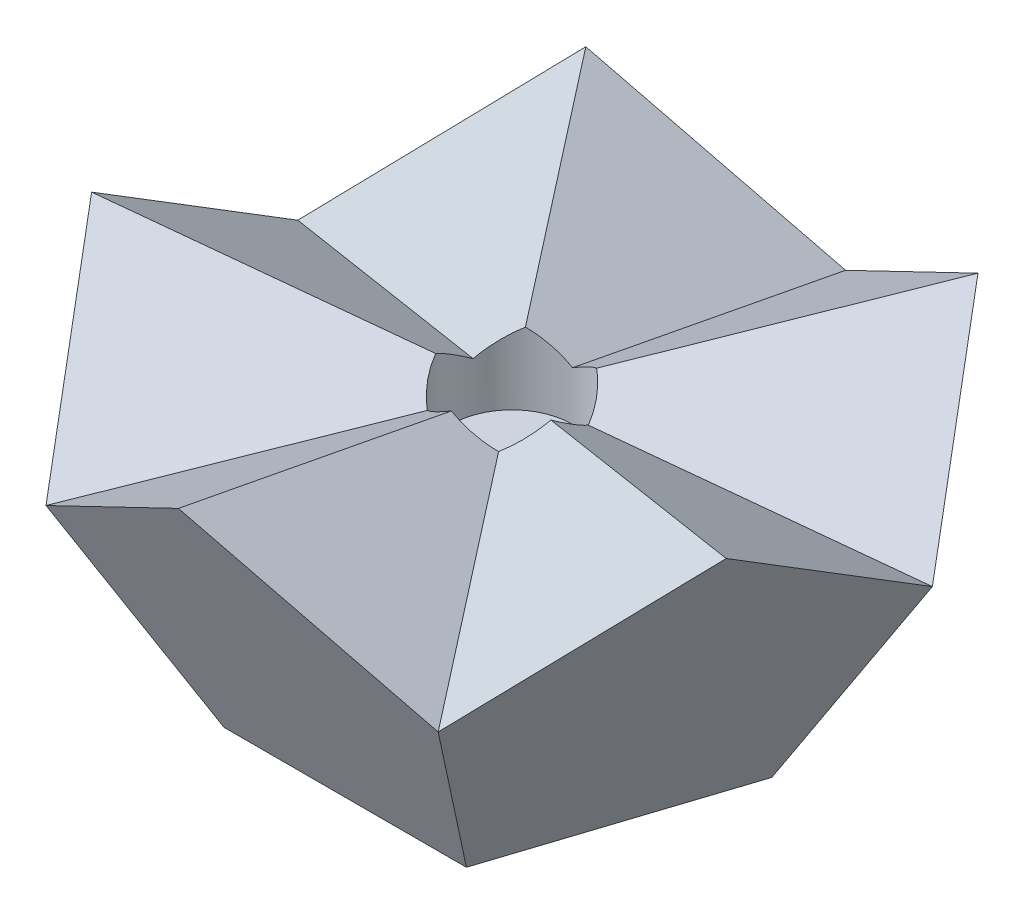
ISO-10303-21;
HEADER;
FILE_DESCRIPTION(('STEP AP214'),'2;1');
FILE_NAME('part.step','',(''),(''),'','','');
FILE_SCHEMA(('AUTOMOTIVE_DESIGN { 1 0 10303 214 1 1 1 1 }'));
ENDSEC;
DATA;
#1=APPLICATION_CONTEXT('core data for automotive mechanical design processes');
#2=APPLICATION_PROTOCOL_DEFINITION('international standard','automotive_design',2000,#1);
#3=PRODUCT_CONTEXT('',#1,'mechanical');
#4=PRODUCT('Part','Part','',(#3));
#5=PRODUCT_RELATED_PRODUCT_CATEGORY('part','',(#4));
#6=PRODUCT_DEFINITION_FORMATION('','',#4);
#7=PRODUCT_DEFINITION_CONTEXT('part definition',#1,'design');
#8=PRODUCT_DEFINITION('design','',#6,#7);
#9=PRODUCT_DEFINITION_SHAPE('','',#8);
#10=(LENGTH_UNIT() NAMED_UNIT(*) SI_UNIT(.MILLI.,.METRE.));
#11=(NAMED_UNIT(*) PLANE_ANGLE_UNIT() SI_UNIT($,.RADIAN.));
#12=(NAMED_UNIT(*) SI_UNIT($,.STERADIAN.) SOLID_ANGLE_UNIT());
#13=UNCERTAINTY_MEASURE_WITH_UNIT(LENGTH_MEASURE(1.E-05),#10,'distance_accuracy_value','');
#14=(GEOMETRIC_REPRESENTATION_CONTEXT(3) GLOBAL_UNCERTAINTY_ASSIGNED_CONTEXT((#13)) GLOBAL_UNIT_ASSIGNED_CONTEXT((#10,
#11,#12)) REPRESENTATION_CONTEXT('',''));
#15=CARTESIAN_POINT('',(0.,0.,0.));
#16=DIRECTION('',(0.,0.,1.));
#17=DIRECTION('',(1.,0.,0.));
#18=AXIS2_PLACEMENT_3D('',#15,#16,#17);
#19=CARTESIAN_POINT('',(0.,0.,0.));
#20=DIRECTION('',(0.,1.,0.));
#21=DIRECTION('',(0.,0.,1.));
#22=AXIS2_PLACEMENT_3D('',#19,#20,#21);
#23=PLANE('',#22);
#24=DIRECTION('',(-0.809016994374948,0.,-0.587785252292473));
#25=VECTOR('',#24,1.);
#26=CARTESIAN_POINT('',(10.2745158285618,0.,-3.3383925619565));
#27=LINE('',#26,#25);
#28=CARTESIAN_POINT('',(10.2745158285618,0.,-3.3383925619565));
#29=VERTEX_POINT('',#28);
#30=CARTESIAN_POINT('',(0.,0.,-10.8032652660709));
#31=VERTEX_POINT('',#30);
#32=EDGE_CURVE('E143',#29,#31,#27,.T.);
#33=ORIENTED_EDGE('',*,*,#32,.F.);
#34=DIRECTION('',(0.309016994374947,0.,-0.951056516295154));
#35=VECTOR('',#34,1.);
#36=CARTESIAN_POINT('',(6.35,0.,8.74002519499195));
#37=LINE('',#36,#35);
#38=CARTESIAN_POINT('',(6.35,0.,8.74002519499195));
#39=VERTEX_POINT('',#38);
#40=EDGE_CURVE('E42',#39,#29,#37,.T.);
#41=ORIENTED_EDGE('',*,*,#40,.F.);
#42=DIRECTION('',(1.,0.,0.));
#43=VECTOR('',#42,1.);
#44=CARTESIAN_POINT('',(-6.35,0.,8.74002519499195));
#45=LINE('',#44,#43);
#46=CARTESIAN_POINT('',(-6.35,0.,8.74002519499195));
#47=VERTEX_POINT('',#46);
#48=EDGE_CURVE('E156',#47,#39,#45,.T.);
#49=ORIENTED_EDGE('',*,*,#48,.F.);
#50=DIRECTION('',(0.309016994374948,0.,0.951056516295154));
#51=VECTOR('',#50,1.);
#52=CARTESIAN_POINT('',(-10.2745158285618,0.,-3.3383925619565));
#53=LINE('',#52,#51);
#54=CARTESIAN_POINT('',(-10.2745158285618,0.,-3.33839256195649));
#55=VERTEX_POINT('',#54);
#56=EDGE_CURVE('E153',#55,#47,#53,.T.);
#57=ORIENTED_EDGE('',*,*,#56,.F.);
#58=DIRECTION('',(-0.809016994374947,0.,0.587785252292473));
#59=VECTOR('',#58,1.);
#60=CARTESIAN_POINT('',(0.,0.,-10.8032652660709));
#61=LINE('',#60,#59);
#62=EDGE_CURVE('E146',#31,#55,#61,.T.);
#63=ORIENTED_EDGE('',*,*,#62,.F.);
#64=EDGE_LOOP('',(#33,#41,#49,#57,#63));
#65=FACE_BOUND('',#64,.T.);
#66=ADVANCED_FACE('F35',(#65),#23,.F.);
#67=CARTESIAN_POINT('',(10.2745158285618,17.4800503899839,-14.1416578280274));
#68=DIRECTION('',(0.309016994374945,0.850650808352039,0.425325404176022));
#69=DIRECTION('',(0.,-0.44721359549996,0.894427190999915));
#70=AXIS2_PLACEMENT_3D('',#67,#68,#69);
#71=PLANE('',#70);
#72=DIRECTION('',(0.577350269189625,0.187592474085084,-0.794654472291765));
#73=VECTOR('',#72,1.);
#74=CARTESIAN_POINT('',(7.65817194285392,16.6299487293989,-10.5405694060037));
#75=LINE('',#74,#73);
#76=CARTESIAN_POINT('',(1.8662181760286,14.7480288708869,-2.56862895714046));
#77=VERTEX_POINT('',#76);
#78=CARTESIAN_POINT('',(10.2745158285618,17.4800503899839,-14.1416578280274));
#79=VERTEX_POINT('',#78);
#80=EDGE_CURVE('E56',#77,#79,#75,.T.);
#81=ORIENTED_EDGE('',*,*,#80,.F.);
#82=CARTESIAN_POINT('',(0.,14.1416578280274,0.));
#83=DIRECTION('',(0.309016994374945,0.850650808352039,0.425325404176022));
#84=DIRECTION('',(-0.499999999999995,0.525731112119134,-0.68819096023559));
#85=AXIS2_PLACEMENT_3D('',#82,#83,#84);
#86=ELLIPSE('',#85,3.73243635205721,3.175);
#87=CARTESIAN_POINT('',(3.01960443923711,13.5352867851678,-0.981128957140464));
#88=VERTEX_POINT('',#87);
#89=EDGE_CURVE('E127',#77,#88,#86,.F.);
#90=ORIENTED_EDGE('',*,*,#89,.T.);
#91=DIRECTION('',(0.934172358962717,-0.187592474085077,-0.303530999103342));
#92=VECTOR('',#91,1.);
#93=CARTESIAN_POINT('',(12.3911824952285,11.6533669266559,-4.02613925231614));
#94=LINE('',#93,#92);
#95=CARTESIAN_POINT('',(16.6245158285618,10.8032652660709,-5.40163263303547));
#96=VERTEX_POINT('',#95);
#97=EDGE_CURVE('E133',#88,#96,#94,.T.);
#98=ORIENTED_EDGE('',*,*,#97,.T.);
#99=DIRECTION('',(0.500000000000001,-0.525731112119134,0.688190960235586));
#100=VECTOR('',#99,1.);
#101=CARTESIAN_POINT('',(10.2745158285618,17.4800503899839,-14.1416578280274));
#102=LINE('',#101,#100);
#103=EDGE_CURVE('E175',#79,#96,#102,.T.);
#104=ORIENTED_EDGE('',*,*,#103,.F.);
#105=EDGE_LOOP('',(#81,#90,#98,#104));
#106=FACE_BOUND('',#105,.T.);
#107=ADVANCED_FACE('F132',(#106),#71,.T.);
#108=CARTESIAN_POINT('',(0.,10.8032652660709,-17.4800503899839));
#109=DIRECTION('',(-0.500000000000002,0.85065080835204,-0.16245984811645));
#110=DIRECTION('',(-0.862103722396975,-0.506731853971388,0.));
#111=AXIS2_PLACEMENT_3D('',#108,#109,#110);
#112=PLANE('',#111);
#113=DIRECTION('',(0.,-0.187592474085077,-0.982246946376847));
#114=VECTOR('',#113,1.);
#115=CARTESIAN_POINT('',(0.,11.653366926656,-13.0288603073752));
#116=LINE('',#115,#114);
#117=CARTESIAN_POINT('',(0.,13.5352867851678,-3.175));
#118=VERTEX_POINT('',#117);
#119=CARTESIAN_POINT('',(0.,10.8032652660709,-17.4800503899839));
#120=VERTEX_POINT('',#119);
#121=EDGE_CURVE('E148',#118,#120,#116,.T.);
#122=ORIENTED_EDGE('',*,*,#121,.F.);
#123=CARTESIAN_POINT('',(0.,14.1416578280274,0.));
#124=DIRECTION('',(-0.500000000000002,0.85065080835204,-0.16245984811645));
#125=DIRECTION('',(0.809016994374949,0.525731112119134,0.262865556059562));
#126=AXIS2_PLACEMENT_3D('',#123,#124,#125);
#127=ELLIPSE('',#126,3.73243635205721,3.175);
#128=EDGE_CURVE('E396',#118,#77,#127,.F.);
#129=ORIENTED_EDGE('',*,*,#128,.T.);
#130=ORIENTED_EDGE('',*,*,#80,.T.);
#131=DIRECTION('',(0.809016994374947,0.525731112119134,0.262865556059568));
#132=VECTOR('',#131,1.);
#133=CARTESIAN_POINT('',(0.,10.8032652660709,-17.4800503899839));
#134=LINE('',#133,#132);
#135=EDGE_CURVE('E178',#120,#79,#134,.T.);
#136=ORIENTED_EDGE('',*,*,#135,.F.);
#137=EDGE_LOOP('',(#122,#129,#130,#136));
#138=FACE_BOUND('',#137,.T.);
#139=ADVANCED_FACE('F204',(#138),#112,.T.);
#140=CARTESIAN_POINT('',(7.43470949713709,7.81731618442516,-10.2329997358148));
#141=DIRECTION('',(-0.525731112119134,0.447213595499956,0.72360679774998));
#142=DIRECTION('',(0.688190960235586,0.72360679774998,0.0527864045000435));
#143=AXIS2_PLACEMENT_3D('',#140,#141,#142);
#144=PLANE('',#143);
#145=ORIENTED_EDGE('',*,*,#32,.T.);
#146=DIRECTION('',(0.,0.850650808352041,-0.525731112119132));
#147=VECTOR('',#146,1.);
#148=CARTESIAN_POINT('',(0.,0.,-10.8032652660709));
#149=LINE('',#148,#147);
#150=EDGE_CURVE('E186',#31,#120,#149,.T.);
#151=ORIENTED_EDGE('',*,*,#150,.T.);
#152=ORIENTED_EDGE('',*,*,#135,.T.);
#153=ORIENTED_EDGE('',*,*,#103,.T.);
#154=DIRECTION('',(-0.499999999999999,-0.850650808352041,0.162459848116451));
#155=VECTOR('',#154,1.);
#156=CARTESIAN_POINT('',(16.6245158285618,10.8032652660709,-5.40163263303544));
#157=LINE('',#156,#155);
#158=EDGE_CURVE('E163',#96,#29,#157,.T.);
#159=ORIENTED_EDGE('',*,*,#158,.T.);
#160=EDGE_LOOP('',(#145,#151,#152,#153,#159));
#161=FACE_BOUND('',#160,.T.);
#162=ADVANCED_FACE('F173',(#161),#144,.F.);
#163=CARTESIAN_POINT('',(-16.6245158285618,17.4800503899839,5.40163263303545));
#164=DIRECTION('',(0.,0.85065080835204,-0.525731112119134));
#165=DIRECTION('',(0.,0.525731112119134,0.85065080835204));
#166=AXIS2_PLACEMENT_3D('',#163,#164,#165);
#167=PLANE('',#166);
#168=DIRECTION('',(-0.934172358962715,0.187592474085083,0.303530999103343));
#169=VECTOR('',#168,1.);
#170=CARTESIAN_POINT('',(-12.3911824952285,16.6299487293989,4.02613925231614));
#171=LINE('',#170,#169);
#172=CARTESIAN_POINT('',(-3.01960443923711,14.7480288708869,0.981128957140454));
#173=VERTEX_POINT('',#172);
#174=CARTESIAN_POINT('',(-16.6245158285618,17.4800503899839,5.40163263303545));
#175=VERTEX_POINT('',#174);
#176=EDGE_CURVE('E176',#173,#175,#171,.T.);
#177=ORIENTED_EDGE('',*,*,#176,.F.);
#178=CARTESIAN_POINT('',(0.,14.1416578280274,0.));
#179=DIRECTION('',(0.,0.85065080835204,-0.525731112119134));
#180=DIRECTION('',(0.,0.525731112119134,0.85065080835204));
#181=AXIS2_PLACEMENT_3D('',#178,#179,#180);
#182=ELLIPSE('',#181,3.73243635205721,3.175);
#183=CARTESIAN_POINT('',(-3.01960443923711,13.5352867851678,-0.981128957140461));
#184=VERTEX_POINT('',#183);
#185=EDGE_CURVE('E394',#173,#184,#182,.F.);
#186=ORIENTED_EDGE('',*,*,#185,.T.);
#187=DIRECTION('',(-0.934172358962716,-0.187592474085077,-0.303530999103344));
#188=VECTOR('',#187,1.);
#189=CARTESIAN_POINT('',(-12.3911824952285,11.6533669266559,-4.02613925231615));
#190=LINE('',#189,#188);
#191=CARTESIAN_POINT('',(-16.6245158285618,10.8032652660709,-5.40163263303543));
#192=VERTEX_POINT('',#191);
#193=EDGE_CURVE('E363',#184,#192,#190,.T.);
#194=ORIENTED_EDGE('',*,*,#193,.T.);
#195=DIRECTION('',(0.,-0.525731112119134,-0.850650808352039));
#196=VECTOR('',#195,1.);
#197=CARTESIAN_POINT('',(-16.6245158285618,17.4800503899839,5.40163263303545));
#198=LINE('',#197,#196);
#199=EDGE_CURVE('E349',#175,#192,#198,.T.);
#200=ORIENTED_EDGE('',*,*,#199,.F.);
#201=EDGE_LOOP('',(#177,#186,#194,#200));
#202=FACE_BOUND('',#201,.T.);
#203=ADVANCED_FACE('F211',(#202),#167,.T.);
#204=CARTESIAN_POINT('',(-10.2745158285618,10.8032652660709,14.1416578280274));
#205=DIRECTION('',(0.30901699437495,0.85065080835204,0.425325404176019));
#206=DIRECTION('',(0.,-0.447213595499957,0.894427190999916));
#207=AXIS2_PLACEMENT_3D('',#204,#205,#206);
#208=PLANE('',#207);
#209=DIRECTION('',(-0.577350269189625,-0.187592474085078,0.794654472291767));
#210=VECTOR('',#209,1.);
#211=CARTESIAN_POINT('',(-7.65817194285392,11.6533669266559,10.5405694060038));
#212=LINE('',#211,#210);
#213=CARTESIAN_POINT('',(-1.8662181760286,13.5352867851678,2.56862895714046));
#214=VERTEX_POINT('',#213);
#215=CARTESIAN_POINT('',(-10.2745158285618,10.8032652660709,14.1416578280274));
#216=VERTEX_POINT('',#215);
#217=EDGE_CURVE('E180',#214,#216,#212,.T.);
#218=ORIENTED_EDGE('',*,*,#217,.F.);
#219=CARTESIAN_POINT('',(0.,14.1416578280274,0.));
#220=DIRECTION('',(0.30901699437495,0.85065080835204,0.425325404176019));
#221=DIRECTION('',(-0.500000000000004,0.525731112119134,-0.688190960235584));
#222=AXIS2_PLACEMENT_3D('',#219,#220,#221);
#223=ELLIPSE('',#222,3.73243635205721,3.175);
#224=EDGE_CURVE('E392',#214,#173,#223,.F.);
#225=ORIENTED_EDGE('',*,*,#224,.T.);
#226=ORIENTED_EDGE('',*,*,#176,.T.);
#227=DIRECTION('',(-0.499999999999999,0.525731112119134,-0.688190960235587));
#228=VECTOR('',#227,1.);
#229=CARTESIAN_POINT('',(-10.2745158285618,10.8032652660709,14.1416578280274));
#230=LINE('',#229,#228);
#231=EDGE_CURVE('E353',#216,#175,#230,.T.);
#232=ORIENTED_EDGE('',*,*,#231,.F.);
#233=EDGE_LOOP('',(#218,#225,#226,#232));
#234=FACE_BOUND('',#233,.T.);
#235=ADVANCED_FACE('F241',(#234),#208,.T.);
#236=CARTESIAN_POINT('',(-12.0296126628495,7.81731618442516,3.90865809221257));
#237=DIRECTION('',(0.850650808352041,0.447213595499956,-0.276393202250022));
#238=DIRECTION('',(0.42532540417602,-0.276393202250022,0.861803398874989));
#239=AXIS2_PLACEMENT_3D('',#236,#237,#238);
#240=PLANE('',#239);
#241=ORIENTED_EDGE('',*,*,#199,.T.);
#242=DIRECTION('',(0.499999999999999,-0.850650808352041,0.162459848116454));
#243=VECTOR('',#242,1.);
#244=CARTESIAN_POINT('',(-16.6245158285618,10.8032652660709,-5.40163263303546));
#245=LINE('',#244,#243);
#246=EDGE_CURVE('E350',#192,#55,#245,.T.);
#247=ORIENTED_EDGE('',*,*,#246,.T.);
#248=ORIENTED_EDGE('',*,*,#56,.T.);
#249=DIRECTION('',(-0.309016994374946,0.850650808352041,0.42532540417602));
#250=VECTOR('',#249,1.);
#251=CARTESIAN_POINT('',(-6.35,0.,8.74002519499195));
#252=LINE('',#251,#250);
#253=EDGE_CURVE('E357',#47,#216,#252,.T.);
#254=ORIENTED_EDGE('',*,*,#253,.T.);
#255=ORIENTED_EDGE('',*,*,#231,.T.);
#256=EDGE_LOOP('',(#241,#247,#248,#254,#255));
#257=FACE_BOUND('',#256,.T.);
#258=ADVANCED_FACE('F251',(#257),#240,.F.);
#259=CARTESIAN_POINT('',(-10.2745158285618,17.4800503899839,-14.1416578280274));
#260=DIRECTION('',(0.500000000000001,0.85065080835204,-0.162459848116451));
#261=DIRECTION('',(-0.862103722396975,0.506731853971387,0.));
#262=AXIS2_PLACEMENT_3D('',#259,#260,#261);
#263=PLANE('',#262);
#264=DIRECTION('',(-0.577350269189626,0.187592474085083,-0.794654472291765));
#265=VECTOR('',#264,1.);
#266=CARTESIAN_POINT('',(-7.65817194285392,16.6299487293989,-10.5405694060037));
#267=LINE('',#266,#265);
#268=CARTESIAN_POINT('',(-1.8662181760286,14.7480288708869,-2.56862895714046));
#269=VERTEX_POINT('',#268);
#270=CARTESIAN_POINT('',(-10.2745158285618,17.4800503899839,-14.1416578280274));
#271=VERTEX_POINT('',#270);
#272=EDGE_CURVE('E355',#269,#271,#267,.T.);
#273=ORIENTED_EDGE('',*,*,#272,.F.);
#274=CARTESIAN_POINT('',(0.,14.1416578280274,0.));
#275=DIRECTION('',(0.500000000000001,0.85065080835204,-0.162459848116451));
#276=DIRECTION('',(-0.809016994374949,0.525731112119134,0.262865556059562));
#277=AXIS2_PLACEMENT_3D('',#274,#275,#276);
#278=ELLIPSE('',#277,3.7324363520572,3.175);
#279=EDGE_CURVE('E196',#269,#118,#278,.F.);
#280=ORIENTED_EDGE('',*,*,#279,.T.);
#281=ORIENTED_EDGE('',*,*,#121,.T.);
#282=DIRECTION('',(0.809016994374947,-0.525731112119134,-0.262865556059568));
#283=VECTOR('',#282,1.);
#284=CARTESIAN_POINT('',(-10.2745158285618,17.4800503899839,-14.1416578280274));
#285=LINE('',#284,#283);
#286=EDGE_CURVE('E194',#271,#120,#285,.T.);
#287=ORIENTED_EDGE('',*,*,#286,.F.);
#288=EDGE_LOOP('',(#273,#280,#281,#287));
#289=FACE_BOUND('',#288,.T.);
#290=ADVANCED_FACE('F193',(#289),#263,.T.);
#291=CARTESIAN_POINT('',(-16.6245158285618,10.8032652660709,-5.40163263303543));
#292=DIRECTION('',(-0.309016994374945,0.850650808352039,0.425325404176023));
#293=DIRECTION('',(0.,-0.44721359549996,0.894427190999915));
#294=AXIS2_PLACEMENT_3D('',#291,#292,#293);
#295=PLANE('',#294);
#296=ORIENTED_EDGE('',*,*,#193,.F.);
#297=CARTESIAN_POINT('',(0.,14.1416578280274,0.));
#298=DIRECTION('',(-0.309016994374945,0.850650808352039,0.425325404176023));
#299=DIRECTION('',(0.499999999999995,0.525731112119134,-0.688190960235589));
#300=AXIS2_PLACEMENT_3D('',#297,#298,#299);
#301=ELLIPSE('',#300,3.73243635205721,3.175);
#302=EDGE_CURVE('E398',#184,#269,#301,.F.);
#303=ORIENTED_EDGE('',*,*,#302,.T.);
#304=ORIENTED_EDGE('',*,*,#272,.T.);
#305=DIRECTION('',(0.5,0.525731112119134,-0.688190960235586));
#306=VECTOR('',#305,1.);
#307=CARTESIAN_POINT('',(-16.6245158285618,10.8032652660709,-5.40163263303543));
#308=LINE('',#307,#306);
#309=EDGE_CURVE('E201',#192,#271,#308,.T.);
#310=ORIENTED_EDGE('',*,*,#309,.F.);
#311=EDGE_LOOP('',(#296,#303,#304,#310));
#312=FACE_BOUND('',#311,.T.);
#313=ADVANCED_FACE('F263',(#312),#295,.T.);
#314=CARTESIAN_POINT('',(-7.43470949713709,7.81731618442515,-10.2329997358148));
#315=DIRECTION('',(0.525731112119134,0.447213595499956,0.72360679774998));
#316=DIRECTION('',(-0.688190960235586,0.72360679774998,0.0527864045000438));
#317=AXIS2_PLACEMENT_3D('',#314,#315,#316);
#318=PLANE('',#317);
#319=ORIENTED_EDGE('',*,*,#150,.F.);
#320=ORIENTED_EDGE('',*,*,#62,.T.);
#321=ORIENTED_EDGE('',*,*,#246,.F.);
#322=ORIENTED_EDGE('',*,*,#309,.T.);
#323=ORIENTED_EDGE('',*,*,#286,.T.);
#324=EDGE_LOOP('',(#319,#320,#321,#322,#323));
#325=FACE_BOUND('',#324,.T.);
#326=ADVANCED_FACE('F198',(#325),#318,.F.);
#327=CARTESIAN_POINT('',(10.2745158285618,10.8032652660709,14.1416578280274));
#328=DIRECTION('',(0.499999999999999,0.85065080835204,-0.162459848116456));
#329=DIRECTION('',(-0.862103722396976,0.506731853971386,0.));
#330=AXIS2_PLACEMENT_3D('',#327,#328,#329);
#331=PLANE('',#330);
#332=DIRECTION('',(0.577350269189627,-0.187592474085077,0.794654472291766));
#333=VECTOR('',#332,1.);
#334=CARTESIAN_POINT('',(7.65817194285393,11.6533669266559,10.5405694060037));
#335=LINE('',#334,#333);
#336=CARTESIAN_POINT('',(1.86621817602861,13.5352867851678,2.56862895714046));
#337=VERTEX_POINT('',#336);
#338=CARTESIAN_POINT('',(10.2745158285618,10.8032652660709,14.1416578280274));
#339=VERTEX_POINT('',#338);
#340=EDGE_CURVE('E202',#337,#339,#335,.T.);
#341=ORIENTED_EDGE('',*,*,#340,.F.);
#342=CARTESIAN_POINT('',(0.,14.1416578280274,0.));
#343=DIRECTION('',(0.499999999999999,0.85065080835204,-0.162459848116456));
#344=DIRECTION('',(-0.809016994374946,0.525731112119134,0.262865556059572));
#345=AXIS2_PLACEMENT_3D('',#342,#343,#344);
#346=ELLIPSE('',#345,3.7324363520572,3.175);
#347=CARTESIAN_POINT('',(0.,14.7480288708869,3.175));
#348=VERTEX_POINT('',#347);
#349=EDGE_CURVE('E136',#337,#348,#346,.F.);
#350=ORIENTED_EDGE('',*,*,#349,.T.);
#351=DIRECTION('',(0.,0.187592474085083,0.982246946376845));
#352=VECTOR('',#351,1.);
#353=CARTESIAN_POINT('',(0.,16.6299487293989,13.0288603073752));
#354=LINE('',#353,#352);
#355=CARTESIAN_POINT('',(0.,17.4800503899839,17.4800503899839));
#356=VERTEX_POINT('',#355);
#357=EDGE_CURVE('E376',#348,#356,#354,.T.);
#358=ORIENTED_EDGE('',*,*,#357,.T.);
#359=DIRECTION('',(-0.809016994374948,0.525731112119134,0.262865556059566));
#360=VECTOR('',#359,1.);
#361=CARTESIAN_POINT('',(10.2745158285618,10.8032652660709,14.1416578280274));
#362=LINE('',#361,#360);
#363=EDGE_CURVE('E375',#339,#356,#362,.T.);
#364=ORIENTED_EDGE('',*,*,#363,.F.);
#365=EDGE_LOOP('',(#341,#350,#358,#364));
#366=FACE_BOUND('',#365,.T.);
#367=ADVANCED_FACE('F279',(#366),#331,.T.);
#368=CARTESIAN_POINT('',(0.,17.4800503899839,17.4800503899839));
#369=DIRECTION('',(-0.5,0.85065080835204,-0.162459848116456));
#370=DIRECTION('',(-0.862103722396976,-0.506731853971386,0.));
#371=AXIS2_PLACEMENT_3D('',#368,#369,#370);
#372=PLANE('',#371);
#373=ORIENTED_EDGE('',*,*,#357,.F.);
#374=CARTESIAN_POINT('',(0.,14.1416578280274,0.));
#375=DIRECTION('',(-0.5,0.85065080835204,-0.162459848116456));
#376=DIRECTION('',(0.809016994374945,0.525731112119134,0.262865556059572));
#377=AXIS2_PLACEMENT_3D('',#374,#375,#376);
#378=ELLIPSE('',#377,3.73243635205721,3.175);
#379=EDGE_CURVE('E135',#348,#214,#378,.F.);
#380=ORIENTED_EDGE('',*,*,#379,.T.);
#381=ORIENTED_EDGE('',*,*,#217,.T.);
#382=DIRECTION('',(-0.809016994374947,-0.525731112119134,-0.262865556059566));
#383=VECTOR('',#382,1.);
#384=CARTESIAN_POINT('',(0.,17.4800503899839,17.4800503899839));
#385=LINE('',#384,#383);
#386=EDGE_CURVE('E371',#356,#216,#385,.T.);
#387=ORIENTED_EDGE('',*,*,#386,.F.);
#388=EDGE_LOOP('',(#373,#380,#381,#387));
#389=FACE_BOUND('',#388,.T.);
#390=ADVANCED_FACE('F284',(#389),#372,.T.);
#391=CARTESIAN_POINT('',(0.,7.81731618442516,12.6486832872045));
#392=DIRECTION('',(0.,0.447213595499956,-0.894427190999917));
#393=DIRECTION('',(0.,-0.894427190999917,-0.447213595499956));
#394=AXIS2_PLACEMENT_3D('',#391,#392,#393);
#395=PLANE('',#394);
#396=ORIENTED_EDGE('',*,*,#363,.T.);
#397=ORIENTED_EDGE('',*,*,#386,.T.);
#398=ORIENTED_EDGE('',*,*,#253,.F.);
#399=ORIENTED_EDGE('',*,*,#48,.T.);
#400=DIRECTION('',(0.309016994374947,0.850650808352041,0.425325404176018));
#401=VECTOR('',#400,1.);
#402=CARTESIAN_POINT('',(6.35,0.,8.74002519499195));
#403=LINE('',#402,#401);
#404=EDGE_CURVE('E166',#39,#339,#403,.T.);
#405=ORIENTED_EDGE('',*,*,#404,.T.);
#406=EDGE_LOOP('',(#396,#397,#398,#399,#405));
#407=FACE_BOUND('',#406,.T.);
#408=ADVANCED_FACE('F294',(#407),#395,.F.);
#409=CARTESIAN_POINT('',(16.6245158285618,17.4800503899839,5.40163263303544));
#410=DIRECTION('',(-0.30901699437495,0.85065080835204,0.425325404176019));
#411=DIRECTION('',(0.,-0.447213595499957,0.894427190999916));
#412=AXIS2_PLACEMENT_3D('',#409,#410,#411);
#413=PLANE('',#412);
#414=DIRECTION('',(0.934172358962715,0.187592474085083,0.303530999103343));
#415=VECTOR('',#414,1.);
#416=CARTESIAN_POINT('',(12.3911824952285,16.6299487293989,4.02613925231614));
#417=LINE('',#416,#415);
#418=CARTESIAN_POINT('',(3.01960443923711,14.7480288708869,0.981128957140459));
#419=VERTEX_POINT('',#418);
#420=CARTESIAN_POINT('',(16.6245158285618,17.4800503899839,5.40163263303544));
#421=VERTEX_POINT('',#420);
#422=EDGE_CURVE('E379',#419,#421,#417,.T.);
#423=ORIENTED_EDGE('',*,*,#422,.F.);
#424=CARTESIAN_POINT('',(0.,14.1416578280274,0.));
#425=DIRECTION('',(-0.30901699437495,0.85065080835204,0.425325404176019));
#426=DIRECTION('',(0.500000000000003,0.525731112119134,-0.688190960235584));
#427=AXIS2_PLACEMENT_3D('',#424,#425,#426);
#428=ELLIPSE('',#427,3.73243635205721,3.175);
#429=EDGE_CURVE('E49',#419,#337,#428,.F.);
#430=ORIENTED_EDGE('',*,*,#429,.T.);
#431=ORIENTED_EDGE('',*,*,#340,.T.);
#432=DIRECTION('',(-0.499999999999999,-0.525731112119134,0.688190960235587));
#433=VECTOR('',#432,1.);
#434=CARTESIAN_POINT('',(16.6245158285618,17.4800503899839,5.40163263303544));
#435=LINE('',#434,#433);
#436=EDGE_CURVE('E402',#421,#339,#435,.T.);
#437=ORIENTED_EDGE('',*,*,#436,.F.);
#438=EDGE_LOOP('',(#423,#430,#431,#437));
#439=FACE_BOUND('',#438,.T.);
#440=ADVANCED_FACE('F302',(#439),#413,.T.);
#441=CARTESIAN_POINT('',(16.6245158285618,10.8032652660709,-5.40163263303547));
#442=DIRECTION('',(0.,0.85065080835204,-0.525731112119134));
#443=DIRECTION('',(0.,0.525731112119134,0.85065080835204));
#444=AXIS2_PLACEMENT_3D('',#441,#442,#443);
#445=PLANE('',#444);
#446=ORIENTED_EDGE('',*,*,#97,.F.);
#447=CARTESIAN_POINT('',(0.,14.1416578280274,0.));
#448=DIRECTION('',(0.,0.85065080835204,-0.525731112119134));
#449=DIRECTION('',(0.,0.525731112119134,0.85065080835204));
#450=AXIS2_PLACEMENT_3D('',#447,#448,#449);
#451=ELLIPSE('',#450,3.73243635205721,3.175);
#452=EDGE_CURVE('E11',#88,#419,#451,.F.);
#453=ORIENTED_EDGE('',*,*,#452,.T.);
#454=ORIENTED_EDGE('',*,*,#422,.T.);
#455=DIRECTION('',(0.,0.525731112119134,0.85065080835204));
#456=VECTOR('',#455,1.);
#457=CARTESIAN_POINT('',(16.6245158285618,10.8032652660709,-5.40163263303547));
#458=LINE('',#457,#456);
#459=EDGE_CURVE('E141',#96,#421,#458,.T.);
#460=ORIENTED_EDGE('',*,*,#459,.F.);
#461=EDGE_LOOP('',(#446,#453,#454,#460));
#462=FACE_BOUND('',#461,.T.);
#463=ADVANCED_FACE('F139',(#462),#445,.T.);
#464=CARTESIAN_POINT('',(12.0296126628495,7.81731618442516,3.90865809221257));
#465=DIRECTION('',(-0.850650808352041,0.447213595499956,-0.276393202250021));
#466=DIRECTION('',(-0.425325404176019,-0.276393202250021,0.86180339887499));
#467=AXIS2_PLACEMENT_3D('',#464,#465,#466);
#468=PLANE('',#467);
#469=ORIENTED_EDGE('',*,*,#158,.F.);
#470=ORIENTED_EDGE('',*,*,#459,.T.);
#471=ORIENTED_EDGE('',*,*,#436,.T.);
#472=ORIENTED_EDGE('',*,*,#404,.F.);
#473=ORIENTED_EDGE('',*,*,#40,.T.);
#474=EDGE_LOOP('',(#469,#470,#471,#472,#473));
#475=FACE_BOUND('',#474,.T.);
#476=ADVANCED_FACE('F161',(#475),#468,.F.);
#477=CARTESIAN_POINT('',(0.,10.9666578280274,0.));
#478=DIRECTION('',(0.,1.,0.));
#479=DIRECTION('',(0.,0.,1.));
#480=AXIS2_PLACEMENT_3D('',#477,#478,#479);
#481=CYLINDRICAL_SURFACE('',#480,3.175);
#482=ORIENTED_EDGE('',*,*,#302,.F.);
#483=ORIENTED_EDGE('',*,*,#185,.F.);
#484=ORIENTED_EDGE('',*,*,#224,.F.);
#485=ORIENTED_EDGE('',*,*,#379,.F.);
#486=ORIENTED_EDGE('',*,*,#349,.F.);
#487=ORIENTED_EDGE('',*,*,#429,.F.);
#488=ORIENTED_EDGE('',*,*,#452,.F.);
#489=ORIENTED_EDGE('',*,*,#89,.F.);
#490=ORIENTED_EDGE('',*,*,#128,.F.);
#491=ORIENTED_EDGE('',*,*,#279,.F.);
#492=EDGE_LOOP('',(#482,#483,#484,#485,#486,#487,#488,#489,#490,#491));
#493=FACE_BOUND('',#492,.T.);
#494=CARTESIAN_POINT('',(0.,10.9666578280274,0.));
#495=DIRECTION('',(0.,-1.,0.));
#496=DIRECTION('',(0.,0.,-1.));
#497=AXIS2_PLACEMENT_3D('',#494,#495,#496);
#498=CIRCLE('',#497,3.175);
#499=CARTESIAN_POINT('',(0.,10.9666578280274,-3.175));
#500=VERTEX_POINT('',#499);
#501=EDGE_CURVE('E387',#500,#500,#498,.T.);
#502=ORIENTED_EDGE('',*,*,#501,.T.);
#503=EDGE_LOOP('',(#502));
#504=FACE_BOUND('',#503,.T.);
#505=ADVANCED_FACE('F125',(#493,#504),#481,.F.);
#506=CARTESIAN_POINT('',(0.,10.9666578280274,0.));
#507=DIRECTION('',(0.,-1.,0.));
#508=DIRECTION('',(0.,0.,-1.));
#509=AXIS2_PLACEMENT_3D('',#506,#507,#508);
#510=PLANE('',#509);
#511=ORIENTED_EDGE('',*,*,#501,.F.);
#512=EDGE_LOOP('',(#511));
#513=FACE_BOUND('',#512,.T.);
#514=ADVANCED_FACE('F324',(#513),#510,.F.);
#515=CLOSED_SHELL('',(#66,#107,#139,#162,#203,#235,#258,#290,#313,#326,#367,#390,#408,#440,#463,
#476,#505,#514));
#516=MANIFOLD_SOLID_BREP('B2',#515);
#517=ADVANCED_BREP_SHAPE_REPRESENTATION('',(#18,#516),#14);
#518=SHAPE_DEFINITION_REPRESENTATION(#9,#517);
ENDSEC;
END-ISO-10303-21;
